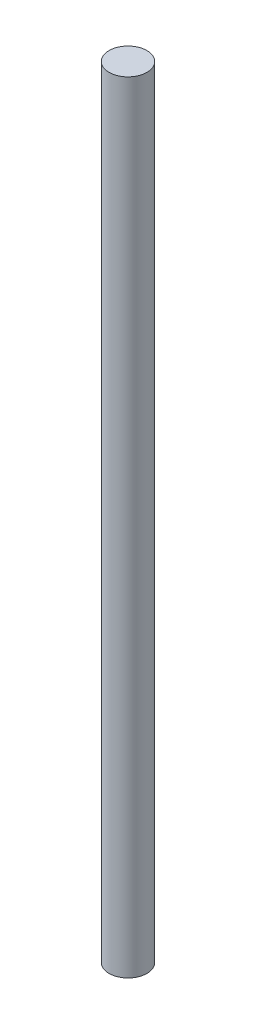
ISO-10303-21;
HEADER;
FILE_DESCRIPTION(('STEP AP214'),'2;1');
FILE_NAME('part.step','',(''),(''),'','','');
FILE_SCHEMA(('AUTOMOTIVE_DESIGN { 1 0 10303 214 1 1 1 1 }'));
ENDSEC;
DATA;
#1=APPLICATION_CONTEXT('core data for automotive mechanical design processes');
#2=APPLICATION_PROTOCOL_DEFINITION('international standard','automotive_design',2000,#1);
#3=PRODUCT_CONTEXT('',#1,'mechanical');
#4=PRODUCT('Part','Part','',(#3));
#5=PRODUCT_RELATED_PRODUCT_CATEGORY('part','',(#4));
#6=PRODUCT_DEFINITION_FORMATION('','',#4);
#7=PRODUCT_DEFINITION_CONTEXT('part definition',#1,'design');
#8=PRODUCT_DEFINITION('design','',#6,#7);
#9=PRODUCT_DEFINITION_SHAPE('','',#8);
#10=(LENGTH_UNIT() NAMED_UNIT(*) SI_UNIT(.MILLI.,.METRE.));
#11=(NAMED_UNIT(*) PLANE_ANGLE_UNIT() SI_UNIT($,.RADIAN.));
#12=(NAMED_UNIT(*) SI_UNIT($,.STERADIAN.) SOLID_ANGLE_UNIT());
#13=UNCERTAINTY_MEASURE_WITH_UNIT(LENGTH_MEASURE(1.E-05),#10,'distance_accuracy_value','');
#14=(GEOMETRIC_REPRESENTATION_CONTEXT(3) GLOBAL_UNCERTAINTY_ASSIGNED_CONTEXT((#13)) GLOBAL_UNIT_ASSIGNED_CONTEXT((#10,
#11,#12)) REPRESENTATION_CONTEXT('',''));
#15=CARTESIAN_POINT('',(0.,0.,0.));
#16=DIRECTION('',(0.,0.,1.));
#17=DIRECTION('',(1.,0.,0.));
#18=AXIS2_PLACEMENT_3D('',#15,#16,#17);
#19=CARTESIAN_POINT('',(0.,66.,0.));
#20=DIRECTION('',(0.,-1.,0.));
#21=DIRECTION('',(0.,0.,-1.));
#22=AXIS2_PLACEMENT_3D('',#19,#20,#21);
#23=CYLINDRICAL_SURFACE('',#22,1.6);
#24=CARTESIAN_POINT('',(0.,66.,0.));
#25=DIRECTION('',(0.,1.,0.));
#26=DIRECTION('',(0.,0.,1.));
#27=AXIS2_PLACEMENT_3D('',#24,#25,#26);
#28=CIRCLE('',#27,1.6);
#29=CARTESIAN_POINT('',(0.,66.,1.6));
#30=VERTEX_POINT('',#29);
#31=EDGE_CURVE('E10',#30,#30,#28,.T.);
#32=ORIENTED_EDGE('',*,*,#31,.F.);
#33=EDGE_LOOP('',(#32));
#34=FACE_BOUND('',#33,.T.);
#35=CARTESIAN_POINT('',(0.,0.,0.));
#36=DIRECTION('',(0.,1.,0.));
#37=DIRECTION('',(0.,0.,1.));
#38=AXIS2_PLACEMENT_3D('',#35,#36,#37);
#39=CIRCLE('',#38,1.6);
#40=CARTESIAN_POINT('',(0.,0.,1.6));
#41=VERTEX_POINT('',#40);
#42=EDGE_CURVE('E46',#41,#41,#39,.T.);
#43=ORIENTED_EDGE('',*,*,#42,.T.);
#44=EDGE_LOOP('',(#43));
#45=FACE_BOUND('',#44,.T.);
#46=ADVANCED_FACE('F43',(#34,#45),#23,.T.);
#47=CARTESIAN_POINT('',(0.,66.,0.));
#48=DIRECTION('',(0.,1.,0.));
#49=DIRECTION('',(0.,0.,1.));
#50=AXIS2_PLACEMENT_3D('',#47,#48,#49);
#51=PLANE('',#50);
#52=ORIENTED_EDGE('',*,*,#31,.T.);
#53=EDGE_LOOP('',(#52));
#54=FACE_BOUND('',#53,.T.);
#55=ADVANCED_FACE('F60',(#54),#51,.T.);
#56=CARTESIAN_POINT('',(0.,0.,0.));
#57=DIRECTION('',(0.,1.,0.));
#58=DIRECTION('',(0.,0.,1.));
#59=AXIS2_PLACEMENT_3D('',#56,#57,#58);
#60=PLANE('',#59);
#61=ORIENTED_EDGE('',*,*,#42,.F.);
#62=EDGE_LOOP('',(#61));
#63=FACE_BOUND('',#62,.T.);
#64=ADVANCED_FACE('F58',(#63),#60,.F.);
#65=CLOSED_SHELL('',(#46,#55,#64));
#66=MANIFOLD_SOLID_BREP('B2',#65);
#67=ADVANCED_BREP_SHAPE_REPRESENTATION('',(#18,#66),#14);
#68=SHAPE_DEFINITION_REPRESENTATION(#9,#67);
ENDSEC;
END-ISO-10303-21;
